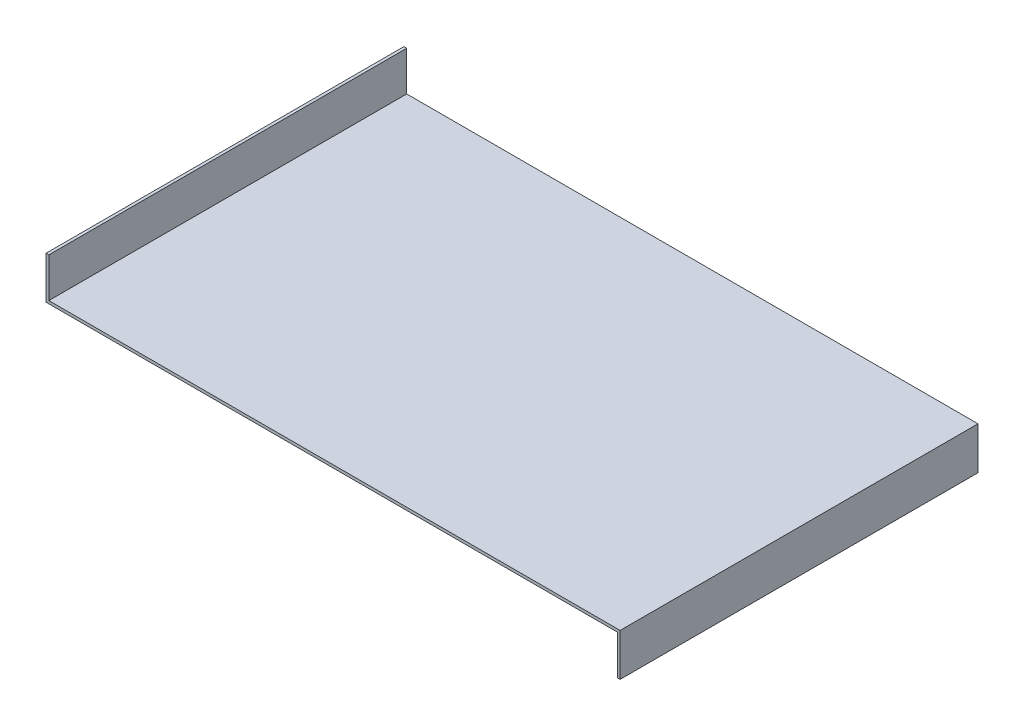
ISO-10303-21;
HEADER;
FILE_DESCRIPTION(('STEP AP214'),'2;1');
FILE_NAME('part.step','',(''),(''),'','','');
FILE_SCHEMA(('AUTOMOTIVE_DESIGN { 1 0 10303 214 1 1 1 1 }'));
ENDSEC;
DATA;
#1=APPLICATION_CONTEXT('core data for automotive mechanical design processes');
#2=APPLICATION_PROTOCOL_DEFINITION('international standard','automotive_design',2000,#1);
#3=PRODUCT_CONTEXT('',#1,'mechanical');
#4=PRODUCT('Part','Part','',(#3));
#5=PRODUCT_RELATED_PRODUCT_CATEGORY('part','',(#4));
#6=PRODUCT_DEFINITION_FORMATION('','',#4);
#7=PRODUCT_DEFINITION_CONTEXT('part definition',#1,'design');
#8=PRODUCT_DEFINITION('design','',#6,#7);
#9=PRODUCT_DEFINITION_SHAPE('','',#8);
#10=(LENGTH_UNIT() NAMED_UNIT(*) SI_UNIT(.MILLI.,.METRE.));
#11=(NAMED_UNIT(*) PLANE_ANGLE_UNIT() SI_UNIT($,.RADIAN.));
#12=(NAMED_UNIT(*) SI_UNIT($,.STERADIAN.) SOLID_ANGLE_UNIT());
#13=UNCERTAINTY_MEASURE_WITH_UNIT(LENGTH_MEASURE(1.E-05),#10,'distance_accuracy_value','');
#14=(GEOMETRIC_REPRESENTATION_CONTEXT(3) GLOBAL_UNCERTAINTY_ASSIGNED_CONTEXT((#13)) GLOBAL_UNIT_ASSIGNED_CONTEXT((#10,
#11,#12)) REPRESENTATION_CONTEXT('',''));
#15=CARTESIAN_POINT('',(0.,0.,0.));
#16=DIRECTION('',(0.,0.,1.));
#17=DIRECTION('',(1.,0.,0.));
#18=AXIS2_PLACEMENT_3D('',#15,#16,#17);
#19=CARTESIAN_POINT('',(-1.,0.,126.55));
#20=DIRECTION('',(0.,1.,0.));
#21=DIRECTION('',(0.,0.,1.));
#22=AXIS2_PLACEMENT_3D('',#19,#20,#21);
#23=PLANE('',#22);
#24=DIRECTION('',(1.,0.,0.));
#25=VECTOR('',#24,1.);
#26=CARTESIAN_POINT('',(-1.,0.,0.));
#27=LINE('',#26,#25);
#28=CARTESIAN_POINT('',(-1.,0.,0.));
#29=VERTEX_POINT('',#28);
#30=CARTESIAN_POINT('',(0.,0.,0.));
#31=VERTEX_POINT('',#30);
#32=EDGE_CURVE('E130',#29,#31,#27,.T.);
#33=ORIENTED_EDGE('',*,*,#32,.T.);
#34=DIRECTION('',(0.,0.,-1.));
#35=VECTOR('',#34,1.);
#36=CARTESIAN_POINT('',(0.,0.,126.55));
#37=LINE('',#36,#35);
#38=CARTESIAN_POINT('',(0.,0.,126.55));
#39=VERTEX_POINT('',#38);
#40=EDGE_CURVE('E11',#39,#31,#37,.T.);
#41=ORIENTED_EDGE('',*,*,#40,.F.);
#42=DIRECTION('',(1.,0.,0.));
#43=VECTOR('',#42,1.);
#44=CARTESIAN_POINT('',(-1.,0.,126.55));
#45=LINE('',#44,#43);
#46=CARTESIAN_POINT('',(-1.,0.,126.55));
#47=VERTEX_POINT('',#46);
#48=EDGE_CURVE('E144',#47,#39,#45,.T.);
#49=ORIENTED_EDGE('',*,*,#48,.F.);
#50=DIRECTION('',(0.,0.,-1.));
#51=VECTOR('',#50,1.);
#52=CARTESIAN_POINT('',(-1.,0.,126.55));
#53=LINE('',#52,#51);
#54=EDGE_CURVE('E126',#47,#29,#53,.T.);
#55=ORIENTED_EDGE('',*,*,#54,.T.);
#56=EDGE_LOOP('',(#33,#41,#49,#55));
#57=FACE_BOUND('',#56,.T.);
#58=ADVANCED_FACE('F34',(#57),#23,.F.);
#59=CARTESIAN_POINT('',(0.,0.,126.55));
#60=DIRECTION('',(-1.,0.,0.));
#61=DIRECTION('',(0.,0.,1.));
#62=AXIS2_PLACEMENT_3D('',#59,#60,#61);
#63=PLANE('',#62);
#64=DIRECTION('',(0.,1.,0.));
#65=VECTOR('',#64,1.);
#66=CARTESIAN_POINT('',(0.,0.,0.));
#67=LINE('',#66,#65);
#68=CARTESIAN_POINT('',(0.,15.,0.));
#69=VERTEX_POINT('',#68);
#70=EDGE_CURVE('E133',#31,#69,#67,.T.);
#71=ORIENTED_EDGE('',*,*,#70,.T.);
#72=DIRECTION('',(0.,0.,-1.));
#73=VECTOR('',#72,1.);
#74=CARTESIAN_POINT('',(0.,15.,126.55));
#75=LINE('',#74,#73);
#76=CARTESIAN_POINT('',(0.,15.,126.55));
#77=VERTEX_POINT('',#76);
#78=EDGE_CURVE('E42',#77,#69,#75,.T.);
#79=ORIENTED_EDGE('',*,*,#78,.F.);
#80=DIRECTION('',(0.,1.,0.));
#81=VECTOR('',#80,1.);
#82=CARTESIAN_POINT('',(0.,0.,126.55));
#83=LINE('',#82,#81);
#84=EDGE_CURVE('E93',#39,#77,#83,.T.);
#85=ORIENTED_EDGE('',*,*,#84,.F.);
#86=ORIENTED_EDGE('',*,*,#40,.T.);
#87=EDGE_LOOP('',(#71,#79,#85,#86));
#88=FACE_BOUND('',#87,.T.);
#89=ADVANCED_FACE('F179',(#88),#63,.F.);
#90=CARTESIAN_POINT('',(0.,15.,126.55));
#91=DIRECTION('',(0.,-1.,0.));
#92=DIRECTION('',(1.,0.,0.));
#93=AXIS2_PLACEMENT_3D('',#90,#91,#92);
#94=PLANE('',#93);
#95=DIRECTION('',(-1.,0.,0.));
#96=VECTOR('',#95,1.);
#97=CARTESIAN_POINT('',(0.,15.,0.));
#98=LINE('',#97,#96);
#99=CARTESIAN_POINT('',(-202.,15.,0.));
#100=VERTEX_POINT('',#99);
#101=EDGE_CURVE('E135',#69,#100,#98,.T.);
#102=ORIENTED_EDGE('',*,*,#101,.T.);
#103=DIRECTION('',(0.,0.,-1.));
#104=VECTOR('',#103,1.);
#105=CARTESIAN_POINT('',(-202.,15.,126.55));
#106=LINE('',#105,#104);
#107=CARTESIAN_POINT('',(-202.,15.,126.55));
#108=VERTEX_POINT('',#107);
#109=EDGE_CURVE('E151',#108,#100,#106,.T.);
#110=ORIENTED_EDGE('',*,*,#109,.F.);
#111=DIRECTION('',(-1.,0.,0.));
#112=VECTOR('',#111,1.);
#113=CARTESIAN_POINT('',(0.,15.,126.55));
#114=LINE('',#113,#112);
#115=EDGE_CURVE('E159',#77,#108,#114,.T.);
#116=ORIENTED_EDGE('',*,*,#115,.F.);
#117=ORIENTED_EDGE('',*,*,#78,.T.);
#118=EDGE_LOOP('',(#102,#110,#116,#117));
#119=FACE_BOUND('',#118,.T.);
#120=ADVANCED_FACE('F157',(#119),#94,.F.);
#121=CARTESIAN_POINT('',(-202.,15.,126.55));
#122=DIRECTION('',(-1.,0.,0.));
#123=DIRECTION('',(0.,0.,1.));
#124=AXIS2_PLACEMENT_3D('',#121,#122,#123);
#125=PLANE('',#124);
#126=DIRECTION('',(0.,1.,0.));
#127=VECTOR('',#126,1.);
#128=CARTESIAN_POINT('',(-202.,15.,0.));
#129=LINE('',#128,#127);
#130=CARTESIAN_POINT('',(-202.,29.,0.));
#131=VERTEX_POINT('',#130);
#132=EDGE_CURVE('E137',#100,#131,#129,.T.);
#133=ORIENTED_EDGE('',*,*,#132,.T.);
#134=DIRECTION('',(0.,0.,-1.));
#135=VECTOR('',#134,1.);
#136=CARTESIAN_POINT('',(-202.,29.,126.55));
#137=LINE('',#136,#135);
#138=CARTESIAN_POINT('',(-202.,29.,126.55));
#139=VERTEX_POINT('',#138);
#140=EDGE_CURVE('E148',#139,#131,#137,.T.);
#141=ORIENTED_EDGE('',*,*,#140,.F.);
#142=DIRECTION('',(0.,1.,0.));
#143=VECTOR('',#142,1.);
#144=CARTESIAN_POINT('',(-202.,15.,126.55));
#145=LINE('',#144,#143);
#146=EDGE_CURVE('E171',#108,#139,#145,.T.);
#147=ORIENTED_EDGE('',*,*,#146,.F.);
#148=ORIENTED_EDGE('',*,*,#109,.T.);
#149=EDGE_LOOP('',(#133,#141,#147,#148));
#150=FACE_BOUND('',#149,.T.);
#151=ADVANCED_FACE('F167',(#150),#125,.F.);
#152=CARTESIAN_POINT('',(-202.,29.,126.55));
#153=DIRECTION('',(0.,-1.,0.));
#154=DIRECTION('',(0.,0.,-1.));
#155=AXIS2_PLACEMENT_3D('',#152,#153,#154);
#156=PLANE('',#155);
#157=DIRECTION('',(-1.,0.,0.));
#158=VECTOR('',#157,1.);
#159=CARTESIAN_POINT('',(-202.,29.,0.));
#160=LINE('',#159,#158);
#161=CARTESIAN_POINT('',(-203.,29.,0.));
#162=VERTEX_POINT('',#161);
#163=EDGE_CURVE('E139',#131,#162,#160,.T.);
#164=ORIENTED_EDGE('',*,*,#163,.T.);
#165=DIRECTION('',(0.,0.,-1.));
#166=VECTOR('',#165,1.);
#167=CARTESIAN_POINT('',(-203.,29.,126.55));
#168=LINE('',#167,#166);
#169=CARTESIAN_POINT('',(-203.,29.,126.55));
#170=VERTEX_POINT('',#169);
#171=EDGE_CURVE('E121',#170,#162,#168,.T.);
#172=ORIENTED_EDGE('',*,*,#171,.F.);
#173=DIRECTION('',(-1.,0.,0.));
#174=VECTOR('',#173,1.);
#175=CARTESIAN_POINT('',(-202.,29.,126.55));
#176=LINE('',#175,#174);
#177=EDGE_CURVE('E112',#139,#170,#176,.T.);
#178=ORIENTED_EDGE('',*,*,#177,.F.);
#179=ORIENTED_EDGE('',*,*,#140,.T.);
#180=EDGE_LOOP('',(#164,#172,#178,#179));
#181=FACE_BOUND('',#180,.T.);
#182=ADVANCED_FACE('F170',(#181),#156,.F.);
#183=CARTESIAN_POINT('',(-203.,29.,126.55));
#184=DIRECTION('',(1.,0.,0.));
#185=DIRECTION('',(0.,0.,-1.));
#186=AXIS2_PLACEMENT_3D('',#183,#184,#185);
#187=PLANE('',#186);
#188=DIRECTION('',(0.,-1.,0.));
#189=VECTOR('',#188,1.);
#190=CARTESIAN_POINT('',(-203.,29.,0.));
#191=LINE('',#190,#189);
#192=CARTESIAN_POINT('',(-203.,14.,0.));
#193=VERTEX_POINT('',#192);
#194=EDGE_CURVE('E120',#162,#193,#191,.T.);
#195=ORIENTED_EDGE('',*,*,#194,.T.);
#196=DIRECTION('',(0.,0.,-1.));
#197=VECTOR('',#196,1.);
#198=CARTESIAN_POINT('',(-203.,14.,126.55));
#199=LINE('',#198,#197);
#200=CARTESIAN_POINT('',(-203.,14.,126.55));
#201=VERTEX_POINT('',#200);
#202=EDGE_CURVE('E117',#201,#193,#199,.T.);
#203=ORIENTED_EDGE('',*,*,#202,.F.);
#204=DIRECTION('',(0.,-1.,0.));
#205=VECTOR('',#204,1.);
#206=CARTESIAN_POINT('',(-203.,29.,126.55));
#207=LINE('',#206,#205);
#208=EDGE_CURVE('E106',#170,#201,#207,.T.);
#209=ORIENTED_EDGE('',*,*,#208,.F.);
#210=ORIENTED_EDGE('',*,*,#171,.T.);
#211=EDGE_LOOP('',(#195,#203,#209,#210));
#212=FACE_BOUND('',#211,.T.);
#213=ADVANCED_FACE('F118',(#212),#187,.F.);
#214=CARTESIAN_POINT('',(-203.,14.,126.55));
#215=DIRECTION('',(0.,1.,0.));
#216=DIRECTION('',(0.,0.,1.));
#217=AXIS2_PLACEMENT_3D('',#214,#215,#216);
#218=PLANE('',#217);
#219=DIRECTION('',(1.,0.,0.));
#220=VECTOR('',#219,1.);
#221=CARTESIAN_POINT('',(-203.,14.,0.));
#222=LINE('',#221,#220);
#223=CARTESIAN_POINT('',(-1.,14.,0.));
#224=VERTEX_POINT('',#223);
#225=EDGE_CURVE('E79',#193,#224,#222,.T.);
#226=ORIENTED_EDGE('',*,*,#225,.T.);
#227=DIRECTION('',(0.,0.,-1.));
#228=VECTOR('',#227,1.);
#229=CARTESIAN_POINT('',(-1.,14.,126.55));
#230=LINE('',#229,#228);
#231=CARTESIAN_POINT('',(-1.,14.,126.55));
#232=VERTEX_POINT('',#231);
#233=EDGE_CURVE('E122',#232,#224,#230,.T.);
#234=ORIENTED_EDGE('',*,*,#233,.F.);
#235=DIRECTION('',(1.,0.,0.));
#236=VECTOR('',#235,1.);
#237=CARTESIAN_POINT('',(-203.,14.,126.55));
#238=LINE('',#237,#236);
#239=EDGE_CURVE('E110',#201,#232,#238,.T.);
#240=ORIENTED_EDGE('',*,*,#239,.F.);
#241=ORIENTED_EDGE('',*,*,#202,.T.);
#242=EDGE_LOOP('',(#226,#234,#240,#241));
#243=FACE_BOUND('',#242,.T.);
#244=ADVANCED_FACE('F124',(#243),#218,.F.);
#245=CARTESIAN_POINT('',(-1.,14.,126.55));
#246=DIRECTION('',(1.,0.,0.));
#247=DIRECTION('',(0.,1.,0.));
#248=AXIS2_PLACEMENT_3D('',#245,#246,#247);
#249=PLANE('',#248);
#250=DIRECTION('',(0.,-1.,0.));
#251=VECTOR('',#250,1.);
#252=CARTESIAN_POINT('',(-1.,14.,0.));
#253=LINE('',#252,#251);
#254=EDGE_CURVE('E85',#224,#29,#253,.T.);
#255=ORIENTED_EDGE('',*,*,#254,.T.);
#256=ORIENTED_EDGE('',*,*,#54,.F.);
#257=DIRECTION('',(0.,-1.,0.));
#258=VECTOR('',#257,1.);
#259=CARTESIAN_POINT('',(-1.,14.,126.55));
#260=LINE('',#259,#258);
#261=EDGE_CURVE('E50',#232,#47,#260,.T.);
#262=ORIENTED_EDGE('',*,*,#261,.F.);
#263=ORIENTED_EDGE('',*,*,#233,.T.);
#264=EDGE_LOOP('',(#255,#256,#262,#263));
#265=FACE_BOUND('',#264,.T.);
#266=ADVANCED_FACE('F195',(#265),#249,.F.);
#267=CARTESIAN_POINT('',(0.,0.,126.55));
#268=DIRECTION('',(0.,0.,1.));
#269=DIRECTION('',(1.,0.,0.));
#270=AXIS2_PLACEMENT_3D('',#267,#268,#269);
#271=PLANE('',#270);
#272=ORIENTED_EDGE('',*,*,#48,.T.);
#273=ORIENTED_EDGE('',*,*,#84,.T.);
#274=ORIENTED_EDGE('',*,*,#115,.T.);
#275=ORIENTED_EDGE('',*,*,#146,.T.);
#276=ORIENTED_EDGE('',*,*,#177,.T.);
#277=ORIENTED_EDGE('',*,*,#208,.T.);
#278=ORIENTED_EDGE('',*,*,#239,.T.);
#279=ORIENTED_EDGE('',*,*,#261,.T.);
#280=EDGE_LOOP('',(#272,#273,#274,#275,#276,#277,#278,#279));
#281=FACE_BOUND('',#280,.T.);
#282=ADVANCED_FACE('F108',(#281),#271,.T.);
#283=CARTESIAN_POINT('',(0.,0.,0.));
#284=DIRECTION('',(0.,0.,1.));
#285=DIRECTION('',(1.,0.,0.));
#286=AXIS2_PLACEMENT_3D('',#283,#284,#285);
#287=PLANE('',#286);
#288=ORIENTED_EDGE('',*,*,#32,.F.);
#289=ORIENTED_EDGE('',*,*,#254,.F.);
#290=ORIENTED_EDGE('',*,*,#225,.F.);
#291=ORIENTED_EDGE('',*,*,#194,.F.);
#292=ORIENTED_EDGE('',*,*,#163,.F.);
#293=ORIENTED_EDGE('',*,*,#132,.F.);
#294=ORIENTED_EDGE('',*,*,#101,.F.);
#295=ORIENTED_EDGE('',*,*,#70,.F.);
#296=EDGE_LOOP('',(#288,#289,#290,#291,#292,#293,#294,#295));
#297=FACE_BOUND('',#296,.T.);
#298=ADVANCED_FACE('F163',(#297),#287,.F.);
#299=CLOSED_SHELL('',(#58,#89,#120,#151,#182,#213,#244,#266,#282,#298));
#300=MANIFOLD_SOLID_BREP('B2',#299);
#301=ADVANCED_BREP_SHAPE_REPRESENTATION('',(#18,#300),#14);
#302=SHAPE_DEFINITION_REPRESENTATION(#9,#301);
ENDSEC;
END-ISO-10303-21;
